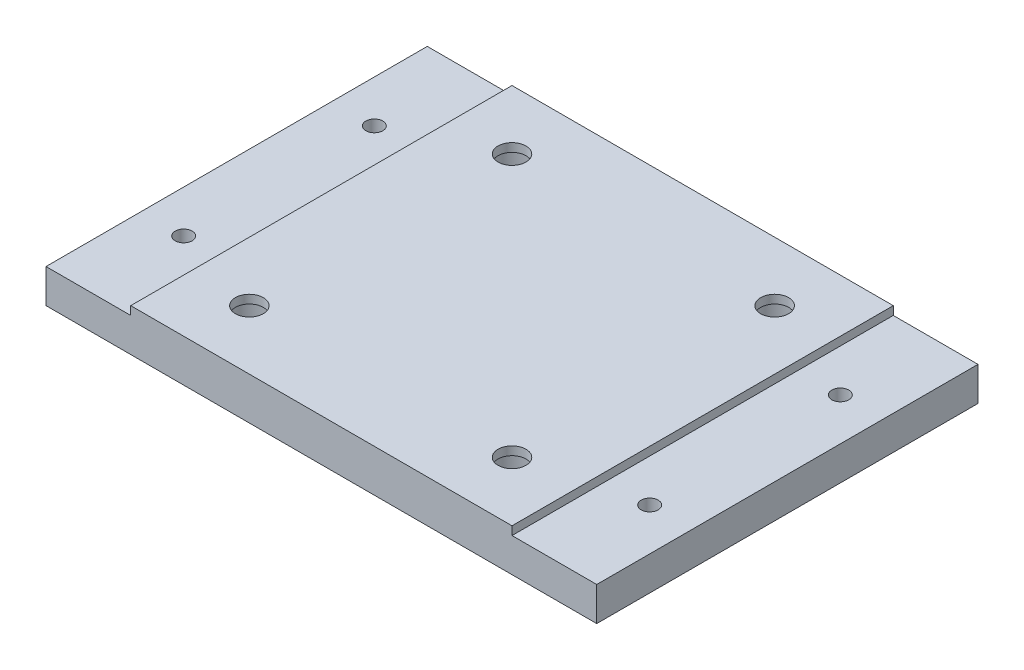
ISO-10303-21;
HEADER;
FILE_DESCRIPTION(('STEP AP214'),'2;1');
FILE_NAME('part.step','',(''),(''),'','','');
FILE_SCHEMA(('AUTOMOTIVE_DESIGN { 1 0 10303 214 1 1 1 1 }'));
ENDSEC;
DATA;
#1=APPLICATION_CONTEXT('core data for automotive mechanical design processes');
#2=APPLICATION_PROTOCOL_DEFINITION('international standard','automotive_design',2000,#1);
#3=PRODUCT_CONTEXT('',#1,'mechanical');
#4=PRODUCT('Part','Part','',(#3));
#5=PRODUCT_RELATED_PRODUCT_CATEGORY('part','',(#4));
#6=PRODUCT_DEFINITION_FORMATION('','',#4);
#7=PRODUCT_DEFINITION_CONTEXT('part definition',#1,'design');
#8=PRODUCT_DEFINITION('design','',#6,#7);
#9=PRODUCT_DEFINITION_SHAPE('','',#8);
#10=(LENGTH_UNIT() NAMED_UNIT(*) SI_UNIT(.MILLI.,.METRE.));
#11=(NAMED_UNIT(*) PLANE_ANGLE_UNIT() SI_UNIT($,.RADIAN.));
#12=(NAMED_UNIT(*) SI_UNIT($,.STERADIAN.) SOLID_ANGLE_UNIT());
#13=UNCERTAINTY_MEASURE_WITH_UNIT(LENGTH_MEASURE(1.E-05),#10,'distance_accuracy_value','');
#14=(GEOMETRIC_REPRESENTATION_CONTEXT(3) GLOBAL_UNCERTAINTY_ASSIGNED_CONTEXT((#13)) GLOBAL_UNIT_ASSIGNED_CONTEXT((#10,
#11,#12)) REPRESENTATION_CONTEXT('',''));
#15=CARTESIAN_POINT('',(0.,0.,0.));
#16=DIRECTION('',(0.,0.,1.));
#17=DIRECTION('',(1.,0.,0.));
#18=AXIS2_PLACEMENT_3D('',#15,#16,#17);
#19=CARTESIAN_POINT('',(0.,4.,0.));
#20=DIRECTION('',(0.,-1.,0.));
#21=DIRECTION('',(0.,0.,-1.));
#22=AXIS2_PLACEMENT_3D('',#19,#20,#21);
#23=PLANE('',#22);
#24=CARTESIAN_POINT('',(-27.5,4.,11.25));
#25=DIRECTION('',(0.,1.,0.));
#26=DIRECTION('',(0.,0.,1.));
#27=AXIS2_PLACEMENT_3D('',#24,#25,#26);
#28=CIRCLE('',#27,1.);
#29=CARTESIAN_POINT('',(-27.5,4.,12.25));
#30=VERTEX_POINT('',#29);
#31=EDGE_CURVE('E160',#30,#30,#28,.T.);
#32=ORIENTED_EDGE('',*,*,#31,.F.);
#33=EDGE_LOOP('',(#32));
#34=FACE_BOUND('',#33,.T.);
#35=CARTESIAN_POINT('',(-27.5,4.,-11.25));
#36=DIRECTION('',(0.,1.,0.));
#37=DIRECTION('',(0.,0.,1.));
#38=AXIS2_PLACEMENT_3D('',#35,#36,#37);
#39=CIRCLE('',#38,1.);
#40=CARTESIAN_POINT('',(-27.5,4.,-10.25));
#41=VERTEX_POINT('',#40);
#42=EDGE_CURVE('E166',#41,#41,#39,.T.);
#43=ORIENTED_EDGE('',*,*,#42,.F.);
#44=EDGE_LOOP('',(#43));
#45=FACE_BOUND('',#44,.T.);
#46=DIRECTION('',(0.,0.,1.));
#47=VECTOR('',#46,1.);
#48=CARTESIAN_POINT('',(-22.5,4.,22.5));
#49=LINE('',#48,#47);
#50=CARTESIAN_POINT('',(-22.5,4.,-22.5));
#51=VERTEX_POINT('',#50);
#52=CARTESIAN_POINT('',(-22.5,4.,22.5));
#53=VERTEX_POINT('',#52);
#54=EDGE_CURVE('E120',#51,#53,#49,.T.);
#55=ORIENTED_EDGE('',*,*,#54,.F.);
#56=DIRECTION('',(-1.,0.,0.));
#57=VECTOR('',#56,1.);
#58=CARTESIAN_POINT('',(-32.5,4.,-22.5));
#59=LINE('',#58,#57);
#60=CARTESIAN_POINT('',(-32.5,4.,-22.5));
#61=VERTEX_POINT('',#60);
#62=EDGE_CURVE('E197',#51,#61,#59,.T.);
#63=ORIENTED_EDGE('',*,*,#62,.T.);
#64=DIRECTION('',(0.,0.,1.));
#65=VECTOR('',#64,1.);
#66=CARTESIAN_POINT('',(-32.5,4.,22.5));
#67=LINE('',#66,#65);
#68=CARTESIAN_POINT('',(-32.5,4.,22.5));
#69=VERTEX_POINT('',#68);
#70=EDGE_CURVE('E193',#61,#69,#67,.T.);
#71=ORIENTED_EDGE('',*,*,#70,.T.);
#72=DIRECTION('',(1.,0.,0.));
#73=VECTOR('',#72,1.);
#74=CARTESIAN_POINT('',(-22.5,4.,22.5));
#75=LINE('',#74,#73);
#76=EDGE_CURVE('E58',#69,#53,#75,.T.);
#77=ORIENTED_EDGE('',*,*,#76,.T.);
#78=EDGE_LOOP('',(#55,#63,#71,#77));
#79=FACE_BOUND('',#78,.T.);
#80=ADVANCED_FACE('F33',(#34,#45,#79),#23,.F.);
#81=CARTESIAN_POINT('',(27.5,4.,11.25));
#82=DIRECTION('',(0.,1.,0.));
#83=DIRECTION('',(0.,0.,1.));
#84=AXIS2_PLACEMENT_3D('',#81,#82,#83);
#85=CIRCLE('',#84,1.);
#86=CARTESIAN_POINT('',(27.5,4.,12.25));
#87=VERTEX_POINT('',#86);
#88=EDGE_CURVE('E146',#87,#87,#85,.T.);
#89=ORIENTED_EDGE('',*,*,#88,.F.);
#90=EDGE_LOOP('',(#89));
#91=FACE_BOUND('',#90,.T.);
#92=CARTESIAN_POINT('',(27.5,4.,-11.25));
#93=DIRECTION('',(0.,1.,0.));
#94=DIRECTION('',(0.,0.,1.));
#95=AXIS2_PLACEMENT_3D('',#92,#93,#94);
#96=CIRCLE('',#95,1.);
#97=CARTESIAN_POINT('',(27.5,4.,-10.25));
#98=VERTEX_POINT('',#97);
#99=EDGE_CURVE('E154',#98,#98,#96,.T.);
#100=ORIENTED_EDGE('',*,*,#99,.F.);
#101=EDGE_LOOP('',(#100));
#102=FACE_BOUND('',#101,.T.);
#103=DIRECTION('',(0.,0.,-1.));
#104=VECTOR('',#103,1.);
#105=CARTESIAN_POINT('',(22.5,4.,-22.5));
#106=LINE('',#105,#104);
#107=CARTESIAN_POINT('',(22.5,4.,22.5));
#108=VERTEX_POINT('',#107);
#109=CARTESIAN_POINT('',(22.5,4.,-22.5));
#110=VERTEX_POINT('',#109);
#111=EDGE_CURVE('E50',#108,#110,#106,.T.);
#112=ORIENTED_EDGE('',*,*,#111,.F.);
#113=CARTESIAN_POINT('',(32.5,4.,22.5));
#114=VERTEX_POINT('',#113);
#115=EDGE_CURVE('E124',#108,#114,#75,.T.);
#116=ORIENTED_EDGE('',*,*,#115,.T.);
#117=DIRECTION('',(0.,0.,-1.));
#118=VECTOR('',#117,1.);
#119=CARTESIAN_POINT('',(32.5,4.,-22.5));
#120=LINE('',#119,#118);
#121=CARTESIAN_POINT('',(32.5,4.,-22.5));
#122=VERTEX_POINT('',#121);
#123=EDGE_CURVE('E210',#114,#122,#120,.T.);
#124=ORIENTED_EDGE('',*,*,#123,.T.);
#125=EDGE_CURVE('E200',#122,#110,#59,.T.);
#126=ORIENTED_EDGE('',*,*,#125,.T.);
#127=EDGE_LOOP('',(#112,#116,#124,#126));
#128=FACE_BOUND('',#127,.T.);
#129=ADVANCED_FACE('F278',(#91,#102,#128),#23,.F.);
#130=CARTESIAN_POINT('',(0.,0.,0.));
#131=DIRECTION('',(0.,-1.,0.));
#132=DIRECTION('',(0.,0.,-1.));
#133=AXIS2_PLACEMENT_3D('',#130,#131,#132);
#134=PLANE('',#133);
#135=CARTESIAN_POINT('',(27.5,0.,-11.25));
#136=DIRECTION('',(0.,1.,0.));
#137=DIRECTION('',(0.,0.,1.));
#138=AXIS2_PLACEMENT_3D('',#135,#136,#137);
#139=CIRCLE('',#138,1.);
#140=CARTESIAN_POINT('',(27.5,0.,-10.25));
#141=VERTEX_POINT('',#140);
#142=EDGE_CURVE('E149',#141,#141,#139,.T.);
#143=ORIENTED_EDGE('',*,*,#142,.T.);
#144=EDGE_LOOP('',(#143));
#145=FACE_BOUND('',#144,.T.);
#146=CARTESIAN_POINT('',(-27.5,0.,-11.25));
#147=DIRECTION('',(0.,1.,0.));
#148=DIRECTION('',(0.,0.,1.));
#149=AXIS2_PLACEMENT_3D('',#146,#147,#148);
#150=CIRCLE('',#149,1.);
#151=CARTESIAN_POINT('',(-27.5,0.,-10.25));
#152=VERTEX_POINT('',#151);
#153=EDGE_CURVE('E163',#152,#152,#150,.T.);
#154=ORIENTED_EDGE('',*,*,#153,.T.);
#155=EDGE_LOOP('',(#154));
#156=FACE_BOUND('',#155,.T.);
#157=CARTESIAN_POINT('',(15.5,0.,15.5));
#158=DIRECTION('',(0.,1.,0.));
#159=DIRECTION('',(0.,0.,1.));
#160=AXIS2_PLACEMENT_3D('',#157,#158,#159);
#161=CIRCLE('',#160,3.);
#162=CARTESIAN_POINT('',(15.5,0.,18.5));
#163=VERTEX_POINT('',#162);
#164=EDGE_CURVE('E174',#163,#163,#161,.T.);
#165=ORIENTED_EDGE('',*,*,#164,.T.);
#166=EDGE_LOOP('',(#165));
#167=FACE_BOUND('',#166,.T.);
#168=CARTESIAN_POINT('',(-15.5,0.,-15.5));
#169=DIRECTION('',(0.,1.,0.));
#170=DIRECTION('',(0.,0.,1.));
#171=AXIS2_PLACEMENT_3D('',#168,#169,#170);
#172=CIRCLE('',#171,3.);
#173=CARTESIAN_POINT('',(-15.5,0.,-12.5));
#174=VERTEX_POINT('',#173);
#175=EDGE_CURVE('E185',#174,#174,#172,.T.);
#176=ORIENTED_EDGE('',*,*,#175,.T.);
#177=EDGE_LOOP('',(#176));
#178=FACE_BOUND('',#177,.T.);
#179=DIRECTION('',(0.,0.,1.));
#180=VECTOR('',#179,1.);
#181=CARTESIAN_POINT('',(-32.5,0.,22.5));
#182=LINE('',#181,#180);
#183=CARTESIAN_POINT('',(-32.5,0.,-22.5));
#184=VERTEX_POINT('',#183);
#185=CARTESIAN_POINT('',(-32.5,0.,22.5));
#186=VERTEX_POINT('',#185);
#187=EDGE_CURVE('E190',#184,#186,#182,.T.);
#188=ORIENTED_EDGE('',*,*,#187,.F.);
#189=DIRECTION('',(-1.,0.,0.));
#190=VECTOR('',#189,1.);
#191=CARTESIAN_POINT('',(-22.5,0.,-22.5));
#192=LINE('',#191,#190);
#193=CARTESIAN_POINT('',(32.5,0.,-22.5));
#194=VERTEX_POINT('',#193);
#195=EDGE_CURVE('E211',#194,#184,#192,.T.);
#196=ORIENTED_EDGE('',*,*,#195,.F.);
#197=DIRECTION('',(0.,0.,-1.));
#198=VECTOR('',#197,1.);
#199=CARTESIAN_POINT('',(32.5,0.,-22.5));
#200=LINE('',#199,#198);
#201=CARTESIAN_POINT('',(32.5,0.,22.5));
#202=VERTEX_POINT('',#201);
#203=EDGE_CURVE('E213',#202,#194,#200,.T.);
#204=ORIENTED_EDGE('',*,*,#203,.F.);
#205=DIRECTION('',(1.,0.,0.));
#206=VECTOR('',#205,1.);
#207=CARTESIAN_POINT('',(32.5,0.,22.5));
#208=LINE('',#207,#206);
#209=EDGE_CURVE('E216',#186,#202,#208,.T.);
#210=ORIENTED_EDGE('',*,*,#209,.F.);
#211=EDGE_LOOP('',(#188,#196,#204,#210));
#212=FACE_BOUND('',#211,.T.);
#213=CARTESIAN_POINT('',(15.5,0.,-15.5));
#214=DIRECTION('',(0.,1.,0.));
#215=DIRECTION('',(0.,0.,1.));
#216=AXIS2_PLACEMENT_3D('',#213,#214,#215);
#217=CIRCLE('',#216,3.);
#218=CARTESIAN_POINT('',(15.5,0.,-12.5));
#219=VERTEX_POINT('',#218);
#220=EDGE_CURVE('E180',#219,#219,#217,.T.);
#221=ORIENTED_EDGE('',*,*,#220,.T.);
#222=EDGE_LOOP('',(#221));
#223=FACE_BOUND('',#222,.T.);
#224=CARTESIAN_POINT('',(-15.5,0.,15.5));
#225=DIRECTION('',(0.,1.,0.));
#226=DIRECTION('',(0.,0.,1.));
#227=AXIS2_PLACEMENT_3D('',#224,#225,#226);
#228=CIRCLE('',#227,3.);
#229=CARTESIAN_POINT('',(-15.5,0.,18.5));
#230=VERTEX_POINT('',#229);
#231=EDGE_CURVE('E169',#230,#230,#228,.T.);
#232=ORIENTED_EDGE('',*,*,#231,.T.);
#233=EDGE_LOOP('',(#232));
#234=FACE_BOUND('',#233,.T.);
#235=CARTESIAN_POINT('',(-27.5,0.,11.25));
#236=DIRECTION('',(0.,1.,0.));
#237=DIRECTION('',(0.,0.,1.));
#238=AXIS2_PLACEMENT_3D('',#235,#236,#237);
#239=CIRCLE('',#238,1.);
#240=CARTESIAN_POINT('',(-27.5,0.,12.25));
#241=VERTEX_POINT('',#240);
#242=EDGE_CURVE('E157',#241,#241,#239,.T.);
#243=ORIENTED_EDGE('',*,*,#242,.T.);
#244=EDGE_LOOP('',(#243));
#245=FACE_BOUND('',#244,.T.);
#246=CARTESIAN_POINT('',(27.5,0.,11.25));
#247=DIRECTION('',(0.,1.,0.));
#248=DIRECTION('',(0.,0.,1.));
#249=AXIS2_PLACEMENT_3D('',#246,#247,#248);
#250=CIRCLE('',#249,1.);
#251=CARTESIAN_POINT('',(27.5,0.,12.25));
#252=VERTEX_POINT('',#251);
#253=EDGE_CURVE('E150',#252,#252,#250,.T.);
#254=ORIENTED_EDGE('',*,*,#253,.T.);
#255=EDGE_LOOP('',(#254));
#256=FACE_BOUND('',#255,.T.);
#257=ADVANCED_FACE('F284',(#145,#156,#167,#178,#212,#223,#234,#245,#256),#134,.T.);
#258=CARTESIAN_POINT('',(-32.5,4.,22.5));
#259=DIRECTION('',(1.,0.,0.));
#260=DIRECTION('',(0.,0.,-1.));
#261=AXIS2_PLACEMENT_3D('',#258,#259,#260);
#262=PLANE('',#261);
#263=ORIENTED_EDGE('',*,*,#187,.T.);
#264=DIRECTION('',(0.,-1.,0.));
#265=VECTOR('',#264,1.);
#266=CARTESIAN_POINT('',(-32.5,4.,22.5));
#267=LINE('',#266,#265);
#268=EDGE_CURVE('E42',#69,#186,#267,.T.);
#269=ORIENTED_EDGE('',*,*,#268,.F.);
#270=ORIENTED_EDGE('',*,*,#70,.F.);
#271=DIRECTION('',(0.,-1.,0.));
#272=VECTOR('',#271,1.);
#273=CARTESIAN_POINT('',(-32.5,4.,-22.5));
#274=LINE('',#273,#272);
#275=EDGE_CURVE('E11',#61,#184,#274,.T.);
#276=ORIENTED_EDGE('',*,*,#275,.T.);
#277=EDGE_LOOP('',(#263,#269,#270,#276));
#278=FACE_BOUND('',#277,.T.);
#279=ADVANCED_FACE('F35',(#278),#262,.F.);
#280=CARTESIAN_POINT('',(32.5,4.,22.5));
#281=DIRECTION('',(0.,0.,-1.));
#282=DIRECTION('',(-1.,0.,0.));
#283=AXIS2_PLACEMENT_3D('',#280,#281,#282);
#284=PLANE('',#283);
#285=ORIENTED_EDGE('',*,*,#209,.T.);
#286=DIRECTION('',(0.,-1.,0.));
#287=VECTOR('',#286,1.);
#288=CARTESIAN_POINT('',(32.5,4.,22.5));
#289=LINE('',#288,#287);
#290=EDGE_CURVE('E204',#114,#202,#289,.T.);
#291=ORIENTED_EDGE('',*,*,#290,.F.);
#292=ORIENTED_EDGE('',*,*,#115,.F.);
#293=DIRECTION('',(0.,-1.,0.));
#294=VECTOR('',#293,1.);
#295=CARTESIAN_POINT('',(22.5,5.,22.5));
#296=LINE('',#295,#294);
#297=CARTESIAN_POINT('',(22.5,5.,22.5));
#298=VERTEX_POINT('',#297);
#299=EDGE_CURVE('E104',#298,#108,#296,.T.);
#300=ORIENTED_EDGE('',*,*,#299,.F.);
#301=DIRECTION('',(1.,0.,0.));
#302=VECTOR('',#301,1.);
#303=CARTESIAN_POINT('',(22.5,5.,22.5));
#304=LINE('',#303,#302);
#305=CARTESIAN_POINT('',(-22.5,5.,22.5));
#306=VERTEX_POINT('',#305);
#307=EDGE_CURVE('E110',#306,#298,#304,.T.);
#308=ORIENTED_EDGE('',*,*,#307,.F.);
#309=DIRECTION('',(0.,-1.,0.));
#310=VECTOR('',#309,1.);
#311=CARTESIAN_POINT('',(-22.5,5.,22.5));
#312=LINE('',#311,#310);
#313=EDGE_CURVE('E139',#306,#53,#312,.T.);
#314=ORIENTED_EDGE('',*,*,#313,.T.);
#315=ORIENTED_EDGE('',*,*,#76,.F.);
#316=ORIENTED_EDGE('',*,*,#268,.T.);
#317=EDGE_LOOP('',(#285,#291,#292,#300,#308,#314,#315,#316));
#318=FACE_BOUND('',#317,.T.);
#319=ADVANCED_FACE('F122',(#318),#284,.F.);
#320=CARTESIAN_POINT('',(32.5,4.,-22.5));
#321=DIRECTION('',(-1.,0.,0.));
#322=DIRECTION('',(0.,0.,1.));
#323=AXIS2_PLACEMENT_3D('',#320,#321,#322);
#324=PLANE('',#323);
#325=ORIENTED_EDGE('',*,*,#203,.T.);
#326=DIRECTION('',(0.,-1.,0.));
#327=VECTOR('',#326,1.);
#328=CARTESIAN_POINT('',(32.5,4.,-22.5));
#329=LINE('',#328,#327);
#330=EDGE_CURVE('E207',#122,#194,#329,.T.);
#331=ORIENTED_EDGE('',*,*,#330,.F.);
#332=ORIENTED_EDGE('',*,*,#123,.F.);
#333=ORIENTED_EDGE('',*,*,#290,.T.);
#334=EDGE_LOOP('',(#325,#331,#332,#333));
#335=FACE_BOUND('',#334,.T.);
#336=ADVANCED_FACE('F298',(#335),#324,.F.);
#337=CARTESIAN_POINT('',(-22.5,4.,-22.5));
#338=DIRECTION('',(0.,0.,1.));
#339=DIRECTION('',(1.,0.,0.));
#340=AXIS2_PLACEMENT_3D('',#337,#338,#339);
#341=PLANE('',#340);
#342=ORIENTED_EDGE('',*,*,#195,.T.);
#343=ORIENTED_EDGE('',*,*,#275,.F.);
#344=ORIENTED_EDGE('',*,*,#62,.F.);
#345=DIRECTION('',(0.,-1.,0.));
#346=VECTOR('',#345,1.);
#347=CARTESIAN_POINT('',(-22.5,5.,-22.5));
#348=LINE('',#347,#346);
#349=CARTESIAN_POINT('',(-22.5,5.,-22.5));
#350=VERTEX_POINT('',#349);
#351=EDGE_CURVE('E130',#350,#51,#348,.T.);
#352=ORIENTED_EDGE('',*,*,#351,.F.);
#353=DIRECTION('',(-1.,0.,0.));
#354=VECTOR('',#353,1.);
#355=CARTESIAN_POINT('',(-22.5,5.,-22.5));
#356=LINE('',#355,#354);
#357=CARTESIAN_POINT('',(22.5,5.,-22.5));
#358=VERTEX_POINT('',#357);
#359=EDGE_CURVE('E109',#358,#350,#356,.T.);
#360=ORIENTED_EDGE('',*,*,#359,.F.);
#361=DIRECTION('',(0.,-1.,0.));
#362=VECTOR('',#361,1.);
#363=CARTESIAN_POINT('',(22.5,5.,-22.5));
#364=LINE('',#363,#362);
#365=EDGE_CURVE('E106',#358,#110,#364,.T.);
#366=ORIENTED_EDGE('',*,*,#365,.T.);
#367=ORIENTED_EDGE('',*,*,#125,.F.);
#368=ORIENTED_EDGE('',*,*,#330,.T.);
#369=EDGE_LOOP('',(#342,#343,#344,#352,#360,#366,#367,#368));
#370=FACE_BOUND('',#369,.T.);
#371=ADVANCED_FACE('F295',(#370),#341,.F.);
#372=CARTESIAN_POINT('',(-15.5,4.,-15.5));
#373=DIRECTION('',(0.,-1.,0.));
#374=DIRECTION('',(0.,0.,-1.));
#375=AXIS2_PLACEMENT_3D('',#372,#373,#374);
#376=CYLINDRICAL_SURFACE('',#375,3.);
#377=CARTESIAN_POINT('',(-15.5,4.,-15.5));
#378=DIRECTION('',(0.,1.,0.));
#379=DIRECTION('',(0.,0.,1.));
#380=AXIS2_PLACEMENT_3D('',#377,#378,#379);
#381=CIRCLE('',#380,3.);
#382=CARTESIAN_POINT('',(-15.5,4.,-12.5));
#383=VERTEX_POINT('',#382);
#384=EDGE_CURVE('E153',#383,#383,#381,.T.);
#385=ORIENTED_EDGE('',*,*,#384,.T.);
#386=EDGE_LOOP('',(#385));
#387=FACE_BOUND('',#386,.T.);
#388=ORIENTED_EDGE('',*,*,#175,.F.);
#389=EDGE_LOOP('',(#388));
#390=FACE_BOUND('',#389,.T.);
#391=ADVANCED_FACE('F290',(#387,#390),#376,.F.);
#392=CARTESIAN_POINT('',(15.5,4.,-15.5));
#393=DIRECTION('',(0.,-1.,0.));
#394=DIRECTION('',(0.,0.,-1.));
#395=AXIS2_PLACEMENT_3D('',#392,#393,#394);
#396=CYLINDRICAL_SURFACE('',#395,3.);
#397=CARTESIAN_POINT('',(15.5,4.,-15.5));
#398=DIRECTION('',(0.,1.,0.));
#399=DIRECTION('',(0.,0.,1.));
#400=AXIS2_PLACEMENT_3D('',#397,#398,#399);
#401=CIRCLE('',#400,3.);
#402=CARTESIAN_POINT('',(15.5,4.,-12.5));
#403=VERTEX_POINT('',#402);
#404=EDGE_CURVE('E177',#403,#403,#401,.T.);
#405=ORIENTED_EDGE('',*,*,#404,.T.);
#406=EDGE_LOOP('',(#405));
#407=FACE_BOUND('',#406,.T.);
#408=ORIENTED_EDGE('',*,*,#220,.F.);
#409=EDGE_LOOP('',(#408));
#410=FACE_BOUND('',#409,.T.);
#411=ADVANCED_FACE('F432',(#407,#410),#396,.F.);
#412=CARTESIAN_POINT('',(15.5,4.,15.5));
#413=DIRECTION('',(0.,-1.,0.));
#414=DIRECTION('',(0.,0.,-1.));
#415=AXIS2_PLACEMENT_3D('',#412,#413,#414);
#416=CYLINDRICAL_SURFACE('',#415,3.);
#417=CARTESIAN_POINT('',(15.5,4.,15.5));
#418=DIRECTION('',(0.,1.,0.));
#419=DIRECTION('',(0.,0.,1.));
#420=AXIS2_PLACEMENT_3D('',#417,#418,#419);
#421=CIRCLE('',#420,3.);
#422=CARTESIAN_POINT('',(15.5,4.,18.5));
#423=VERTEX_POINT('',#422);
#424=EDGE_CURVE('E128',#423,#423,#421,.T.);
#425=ORIENTED_EDGE('',*,*,#424,.T.);
#426=EDGE_LOOP('',(#425));
#427=FACE_BOUND('',#426,.T.);
#428=ORIENTED_EDGE('',*,*,#164,.F.);
#429=EDGE_LOOP('',(#428));
#430=FACE_BOUND('',#429,.T.);
#431=ADVANCED_FACE('F435',(#427,#430),#416,.F.);
#432=CARTESIAN_POINT('',(-15.5,4.,15.5));
#433=DIRECTION('',(0.,-1.,0.));
#434=DIRECTION('',(0.,0.,-1.));
#435=AXIS2_PLACEMENT_3D('',#432,#433,#434);
#436=CYLINDRICAL_SURFACE('',#435,3.);
#437=CARTESIAN_POINT('',(-15.5,4.,15.5));
#438=DIRECTION('',(0.,1.,0.));
#439=DIRECTION('',(0.,0.,1.));
#440=AXIS2_PLACEMENT_3D('',#437,#438,#439);
#441=CIRCLE('',#440,3.);
#442=CARTESIAN_POINT('',(-15.5,4.,18.5));
#443=VERTEX_POINT('',#442);
#444=EDGE_CURVE('E125',#443,#443,#441,.T.);
#445=ORIENTED_EDGE('',*,*,#444,.T.);
#446=EDGE_LOOP('',(#445));
#447=FACE_BOUND('',#446,.T.);
#448=ORIENTED_EDGE('',*,*,#231,.F.);
#449=EDGE_LOOP('',(#448));
#450=FACE_BOUND('',#449,.T.);
#451=ADVANCED_FACE('F460',(#447,#450),#436,.F.);
#452=CARTESIAN_POINT('',(-27.5,4.,-11.25));
#453=DIRECTION('',(0.,-1.,0.));
#454=DIRECTION('',(0.,0.,-1.));
#455=AXIS2_PLACEMENT_3D('',#452,#453,#454);
#456=CYLINDRICAL_SURFACE('',#455,1.);
#457=ORIENTED_EDGE('',*,*,#42,.T.);
#458=EDGE_LOOP('',(#457));
#459=FACE_BOUND('',#458,.T.);
#460=ORIENTED_EDGE('',*,*,#153,.F.);
#461=EDGE_LOOP('',(#460));
#462=FACE_BOUND('',#461,.T.);
#463=ADVANCED_FACE('F456',(#459,#462),#456,.F.);
#464=CARTESIAN_POINT('',(-27.5,4.,11.25));
#465=DIRECTION('',(0.,-1.,0.));
#466=DIRECTION('',(0.,0.,-1.));
#467=AXIS2_PLACEMENT_3D('',#464,#465,#466);
#468=CYLINDRICAL_SURFACE('',#467,1.);
#469=ORIENTED_EDGE('',*,*,#31,.T.);
#470=EDGE_LOOP('',(#469));
#471=FACE_BOUND('',#470,.T.);
#472=ORIENTED_EDGE('',*,*,#242,.F.);
#473=EDGE_LOOP('',(#472));
#474=FACE_BOUND('',#473,.T.);
#475=ADVANCED_FACE('F450',(#471,#474),#468,.F.);
#476=CARTESIAN_POINT('',(27.5,4.,-11.25));
#477=DIRECTION('',(0.,-1.,0.));
#478=DIRECTION('',(0.,0.,-1.));
#479=AXIS2_PLACEMENT_3D('',#476,#477,#478);
#480=CYLINDRICAL_SURFACE('',#479,1.);
#481=ORIENTED_EDGE('',*,*,#99,.T.);
#482=EDGE_LOOP('',(#481));
#483=FACE_BOUND('',#482,.T.);
#484=ORIENTED_EDGE('',*,*,#142,.F.);
#485=EDGE_LOOP('',(#484));
#486=FACE_BOUND('',#485,.T.);
#487=ADVANCED_FACE('F445',(#483,#486),#480,.F.);
#488=CARTESIAN_POINT('',(27.5,4.,11.25));
#489=DIRECTION('',(0.,-1.,0.));
#490=DIRECTION('',(0.,0.,-1.));
#491=AXIS2_PLACEMENT_3D('',#488,#489,#490);
#492=CYLINDRICAL_SURFACE('',#491,1.);
#493=ORIENTED_EDGE('',*,*,#88,.T.);
#494=EDGE_LOOP('',(#493));
#495=FACE_BOUND('',#494,.T.);
#496=ORIENTED_EDGE('',*,*,#253,.F.);
#497=EDGE_LOOP('',(#496));
#498=FACE_BOUND('',#497,.T.);
#499=ADVANCED_FACE('F344',(#495,#498),#492,.F.);
#500=CARTESIAN_POINT('',(0.,4.,0.));
#501=DIRECTION('',(0.,-1.,0.));
#502=DIRECTION('',(0.,0.,-1.));
#503=AXIS2_PLACEMENT_3D('',#500,#501,#502);
#504=PLANE('',#503);
#505=CARTESIAN_POINT('',(-15.5,4.,-15.5));
#506=DIRECTION('',(0.,1.,0.));
#507=DIRECTION('',(0.,0.,1.));
#508=AXIS2_PLACEMENT_3D('',#505,#506,#507);
#509=CIRCLE('',#508,1.65);
#510=CARTESIAN_POINT('',(-15.5,4.,-13.85));
#511=VERTEX_POINT('',#510);
#512=EDGE_CURVE('E254',#511,#511,#509,.T.);
#513=ORIENTED_EDGE('',*,*,#512,.T.);
#514=EDGE_LOOP('',(#513));
#515=FACE_BOUND('',#514,.T.);
#516=ORIENTED_EDGE('',*,*,#384,.F.);
#517=EDGE_LOOP('',(#516));
#518=FACE_BOUND('',#517,.T.);
#519=ADVANCED_FACE('F275',(#515,#518),#504,.T.);
#520=CARTESIAN_POINT('',(15.5,4.,-15.5));
#521=DIRECTION('',(0.,1.,0.));
#522=DIRECTION('',(0.,0.,1.));
#523=AXIS2_PLACEMENT_3D('',#520,#521,#522);
#524=CIRCLE('',#523,1.65);
#525=CARTESIAN_POINT('',(15.5,4.,-13.85));
#526=VERTEX_POINT('',#525);
#527=EDGE_CURVE('E248',#526,#526,#524,.T.);
#528=ORIENTED_EDGE('',*,*,#527,.T.);
#529=EDGE_LOOP('',(#528));
#530=FACE_BOUND('',#529,.T.);
#531=ORIENTED_EDGE('',*,*,#404,.F.);
#532=EDGE_LOOP('',(#531));
#533=FACE_BOUND('',#532,.T.);
#534=ADVANCED_FACE('F343',(#530,#533),#504,.T.);
#535=CARTESIAN_POINT('',(15.5,4.,15.5));
#536=DIRECTION('',(0.,1.,0.));
#537=DIRECTION('',(0.,0.,1.));
#538=AXIS2_PLACEMENT_3D('',#535,#536,#537);
#539=CIRCLE('',#538,1.65);
#540=CARTESIAN_POINT('',(15.5,4.,17.15));
#541=VERTEX_POINT('',#540);
#542=EDGE_CURVE('E242',#541,#541,#539,.T.);
#543=ORIENTED_EDGE('',*,*,#542,.T.);
#544=EDGE_LOOP('',(#543));
#545=FACE_BOUND('',#544,.T.);
#546=ORIENTED_EDGE('',*,*,#424,.F.);
#547=EDGE_LOOP('',(#546));
#548=FACE_BOUND('',#547,.T.);
#549=ADVANCED_FACE('F272',(#545,#548),#504,.T.);
#550=CARTESIAN_POINT('',(-15.5,4.,15.5));
#551=DIRECTION('',(0.,1.,0.));
#552=DIRECTION('',(0.,0.,1.));
#553=AXIS2_PLACEMENT_3D('',#550,#551,#552);
#554=CIRCLE('',#553,1.65);
#555=CARTESIAN_POINT('',(-15.5,4.,17.15));
#556=VERTEX_POINT('',#555);
#557=EDGE_CURVE('E235',#556,#556,#554,.T.);
#558=ORIENTED_EDGE('',*,*,#557,.T.);
#559=EDGE_LOOP('',(#558));
#560=FACE_BOUND('',#559,.T.);
#561=ORIENTED_EDGE('',*,*,#444,.F.);
#562=EDGE_LOOP('',(#561));
#563=FACE_BOUND('',#562,.T.);
#564=ADVANCED_FACE('F264',(#560,#563),#504,.T.);
#565=CARTESIAN_POINT('',(0.,5.,0.));
#566=DIRECTION('',(0.,-1.,0.));
#567=DIRECTION('',(0.,0.,-1.));
#568=AXIS2_PLACEMENT_3D('',#565,#566,#567);
#569=PLANE('',#568);
#570=ORIENTED_EDGE('',*,*,#307,.T.);
#571=DIRECTION('',(0.,0.,-1.));
#572=VECTOR('',#571,1.);
#573=CARTESIAN_POINT('',(22.5,5.,-22.5));
#574=LINE('',#573,#572);
#575=EDGE_CURVE('E100',#298,#358,#574,.T.);
#576=ORIENTED_EDGE('',*,*,#575,.T.);
#577=ORIENTED_EDGE('',*,*,#359,.T.);
#578=DIRECTION('',(0.,0.,1.));
#579=VECTOR('',#578,1.);
#580=CARTESIAN_POINT('',(-22.5,5.,22.5));
#581=LINE('',#580,#579);
#582=EDGE_CURVE('E116',#350,#306,#581,.T.);
#583=ORIENTED_EDGE('',*,*,#582,.T.);
#584=EDGE_LOOP('',(#570,#576,#577,#583));
#585=FACE_BOUND('',#584,.T.);
#586=CARTESIAN_POINT('',(-15.5,5.,15.5));
#587=DIRECTION('',(0.,1.,0.));
#588=DIRECTION('',(0.,0.,1.));
#589=AXIS2_PLACEMENT_3D('',#586,#587,#588);
#590=CIRCLE('',#589,1.65);
#591=CARTESIAN_POINT('',(-15.5,5.,17.15));
#592=VERTEX_POINT('',#591);
#593=EDGE_CURVE('E238',#592,#592,#590,.T.);
#594=ORIENTED_EDGE('',*,*,#593,.F.);
#595=EDGE_LOOP('',(#594));
#596=FACE_BOUND('',#595,.T.);
#597=CARTESIAN_POINT('',(15.5,5.,15.5));
#598=DIRECTION('',(0.,1.,0.));
#599=DIRECTION('',(0.,0.,1.));
#600=AXIS2_PLACEMENT_3D('',#597,#598,#599);
#601=CIRCLE('',#600,1.65);
#602=CARTESIAN_POINT('',(15.5,5.,17.15));
#603=VERTEX_POINT('',#602);
#604=EDGE_CURVE('E239',#603,#603,#601,.T.);
#605=ORIENTED_EDGE('',*,*,#604,.F.);
#606=EDGE_LOOP('',(#605));
#607=FACE_BOUND('',#606,.T.);
#608=CARTESIAN_POINT('',(15.5,5.,-15.5));
#609=DIRECTION('',(0.,1.,0.));
#610=DIRECTION('',(0.,0.,1.));
#611=AXIS2_PLACEMENT_3D('',#608,#609,#610);
#612=CIRCLE('',#611,1.65);
#613=CARTESIAN_POINT('',(15.5,5.,-13.85));
#614=VERTEX_POINT('',#613);
#615=EDGE_CURVE('E245',#614,#614,#612,.T.);
#616=ORIENTED_EDGE('',*,*,#615,.F.);
#617=EDGE_LOOP('',(#616));
#618=FACE_BOUND('',#617,.T.);
#619=CARTESIAN_POINT('',(-15.5,5.,-15.5));
#620=DIRECTION('',(0.,1.,0.));
#621=DIRECTION('',(0.,0.,1.));
#622=AXIS2_PLACEMENT_3D('',#619,#620,#621);
#623=CIRCLE('',#622,1.65);
#624=CARTESIAN_POINT('',(-15.5,5.,-13.85));
#625=VERTEX_POINT('',#624);
#626=EDGE_CURVE('E251',#625,#625,#623,.T.);
#627=ORIENTED_EDGE('',*,*,#626,.F.);
#628=EDGE_LOOP('',(#627));
#629=FACE_BOUND('',#628,.T.);
#630=ADVANCED_FACE('F113',(#585,#596,#607,#618,#629),#569,.F.);
#631=CARTESIAN_POINT('',(22.5,5.,-22.5));
#632=DIRECTION('',(-1.,0.,0.));
#633=DIRECTION('',(0.,0.,1.));
#634=AXIS2_PLACEMENT_3D('',#631,#632,#633);
#635=PLANE('',#634);
#636=ORIENTED_EDGE('',*,*,#111,.T.);
#637=ORIENTED_EDGE('',*,*,#365,.F.);
#638=ORIENTED_EDGE('',*,*,#575,.F.);
#639=ORIENTED_EDGE('',*,*,#299,.T.);
#640=EDGE_LOOP('',(#636,#637,#638,#639));
#641=FACE_BOUND('',#640,.T.);
#642=ADVANCED_FACE('F102',(#641),#635,.F.);
#643=CARTESIAN_POINT('',(-22.5,5.,22.5));
#644=DIRECTION('',(1.,0.,0.));
#645=DIRECTION('',(0.,0.,-1.));
#646=AXIS2_PLACEMENT_3D('',#643,#644,#645);
#647=PLANE('',#646);
#648=ORIENTED_EDGE('',*,*,#54,.T.);
#649=ORIENTED_EDGE('',*,*,#313,.F.);
#650=ORIENTED_EDGE('',*,*,#582,.F.);
#651=ORIENTED_EDGE('',*,*,#351,.T.);
#652=EDGE_LOOP('',(#648,#649,#650,#651));
#653=FACE_BOUND('',#652,.T.);
#654=ADVANCED_FACE('F270',(#653),#647,.F.);
#655=CARTESIAN_POINT('',(-15.5,5.,15.5));
#656=DIRECTION('',(0.,-1.,0.));
#657=DIRECTION('',(0.,0.,-1.));
#658=AXIS2_PLACEMENT_3D('',#655,#656,#657);
#659=CYLINDRICAL_SURFACE('',#658,1.65);
#660=ORIENTED_EDGE('',*,*,#593,.T.);
#661=EDGE_LOOP('',(#660));
#662=FACE_BOUND('',#661,.T.);
#663=ORIENTED_EDGE('',*,*,#557,.F.);
#664=EDGE_LOOP('',(#663));
#665=FACE_BOUND('',#664,.T.);
#666=ADVANCED_FACE('F386',(#662,#665),#659,.F.);
#667=CARTESIAN_POINT('',(15.5,5.,15.5));
#668=DIRECTION('',(0.,-1.,0.));
#669=DIRECTION('',(0.,0.,-1.));
#670=AXIS2_PLACEMENT_3D('',#667,#668,#669);
#671=CYLINDRICAL_SURFACE('',#670,1.65);
#672=ORIENTED_EDGE('',*,*,#604,.T.);
#673=EDGE_LOOP('',(#672));
#674=FACE_BOUND('',#673,.T.);
#675=ORIENTED_EDGE('',*,*,#542,.F.);
#676=EDGE_LOOP('',(#675));
#677=FACE_BOUND('',#676,.T.);
#678=ADVANCED_FACE('F395',(#674,#677),#671,.F.);
#679=CARTESIAN_POINT('',(15.5,5.,-15.5));
#680=DIRECTION('',(0.,-1.,0.));
#681=DIRECTION('',(0.,0.,-1.));
#682=AXIS2_PLACEMENT_3D('',#679,#680,#681);
#683=CYLINDRICAL_SURFACE('',#682,1.65);
#684=ORIENTED_EDGE('',*,*,#615,.T.);
#685=EDGE_LOOP('',(#684));
#686=FACE_BOUND('',#685,.T.);
#687=ORIENTED_EDGE('',*,*,#527,.F.);
#688=EDGE_LOOP('',(#687));
#689=FACE_BOUND('',#688,.T.);
#690=ADVANCED_FACE('F404',(#686,#689),#683,.F.);
#691=CARTESIAN_POINT('',(-15.5,5.,-15.5));
#692=DIRECTION('',(0.,-1.,0.));
#693=DIRECTION('',(0.,0.,-1.));
#694=AXIS2_PLACEMENT_3D('',#691,#692,#693);
#695=CYLINDRICAL_SURFACE('',#694,1.65);
#696=ORIENTED_EDGE('',*,*,#626,.T.);
#697=EDGE_LOOP('',(#696));
#698=FACE_BOUND('',#697,.T.);
#699=ORIENTED_EDGE('',*,*,#512,.F.);
#700=EDGE_LOOP('',(#699));
#701=FACE_BOUND('',#700,.T.);
#702=ADVANCED_FACE('F260',(#698,#701),#695,.F.);
#703=CLOSED_SHELL('',(#80,#129,#257,#279,#319,#336,#371,#391,#411,#431,#451,#463,#475,#487,#499,
#519,#534,#549,#564,#630,#642,#654,#666,#678,#690,#702));
#704=MANIFOLD_SOLID_BREP('B2',#703);
#705=ADVANCED_BREP_SHAPE_REPRESENTATION('',(#18,#704),#14);
#706=SHAPE_DEFINITION_REPRESENTATION(#9,#705);
ENDSEC;
END-ISO-10303-21;
